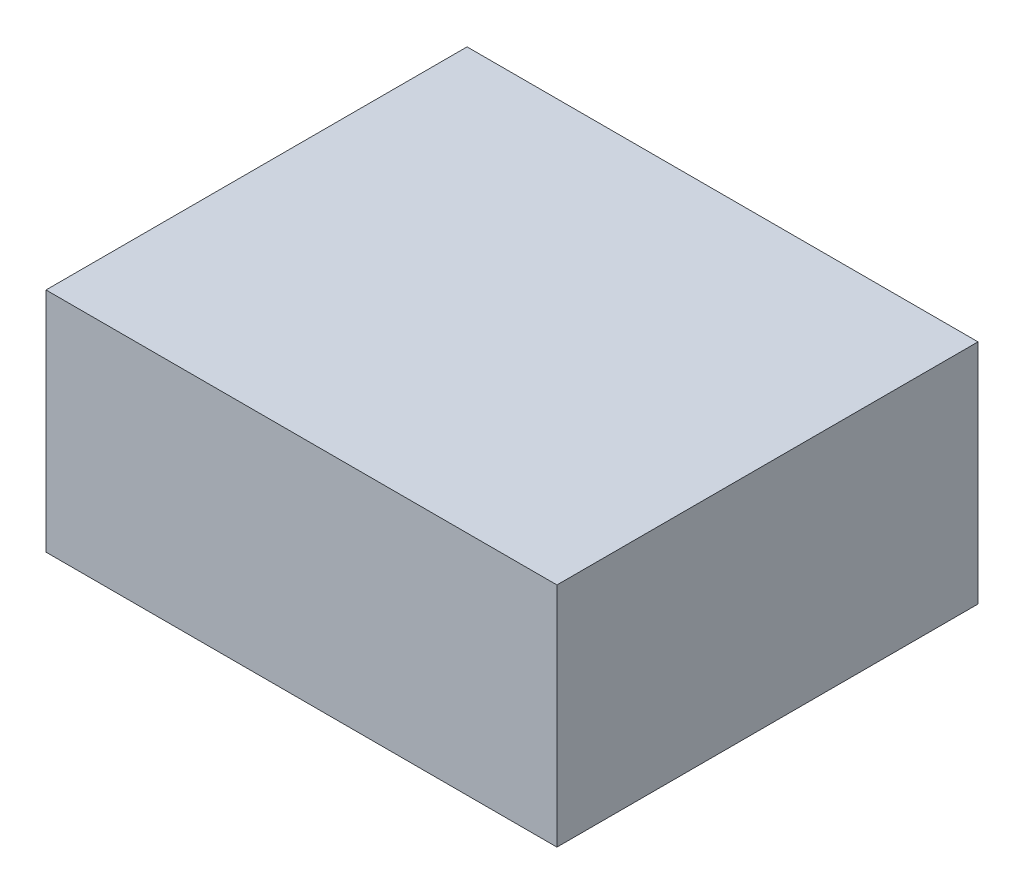
ISO-10303-21;
HEADER;
FILE_DESCRIPTION(('STEP AP214'),'2;1');
FILE_NAME('part.step','',(''),(''),'','','');
FILE_SCHEMA(('AUTOMOTIVE_DESIGN { 1 0 10303 214 1 1 1 1 }'));
ENDSEC;
DATA;
#1=APPLICATION_CONTEXT('core data for automotive mechanical design processes');
#2=APPLICATION_PROTOCOL_DEFINITION('international standard','automotive_design',2000,#1);
#3=PRODUCT_CONTEXT('',#1,'mechanical');
#4=PRODUCT('Part','Part','',(#3));
#5=PRODUCT_RELATED_PRODUCT_CATEGORY('part','',(#4));
#6=PRODUCT_DEFINITION_FORMATION('','',#4);
#7=PRODUCT_DEFINITION_CONTEXT('part definition',#1,'design');
#8=PRODUCT_DEFINITION('design','',#6,#7);
#9=PRODUCT_DEFINITION_SHAPE('','',#8);
#10=(LENGTH_UNIT() NAMED_UNIT(*) SI_UNIT(.MILLI.,.METRE.));
#11=(NAMED_UNIT(*) PLANE_ANGLE_UNIT() SI_UNIT($,.RADIAN.));
#12=(NAMED_UNIT(*) SI_UNIT($,.STERADIAN.) SOLID_ANGLE_UNIT());
#13=UNCERTAINTY_MEASURE_WITH_UNIT(LENGTH_MEASURE(1.E-05),#10,'distance_accuracy_value','');
#14=(GEOMETRIC_REPRESENTATION_CONTEXT(3) GLOBAL_UNCERTAINTY_ASSIGNED_CONTEXT((#13)) GLOBAL_UNIT_ASSIGNED_CONTEXT((#10,
#11,#12)) REPRESENTATION_CONTEXT('',''));
#15=CARTESIAN_POINT('',(0.,0.,0.));
#16=DIRECTION('',(0.,0.,1.));
#17=DIRECTION('',(1.,0.,0.));
#18=AXIS2_PLACEMENT_3D('',#15,#16,#17);
#19=CARTESIAN_POINT('',(5.4000019,-2.39999774,0.));
#20=DIRECTION('',(0.,-1.,0.));
#21=DIRECTION('',(0.,0.,-1.));
#22=AXIS2_PLACEMENT_3D('',#19,#20,#21);
#23=PLANE('',#22);
#24=DIRECTION('',(0.,0.,1.));
#25=VECTOR('',#24,1.);
#26=CARTESIAN_POINT('',(-5.4000019,-2.39999774,0.));
#27=LINE('',#26,#25);
#28=CARTESIAN_POINT('',(-5.4000019,-2.39999774,0.));
#29=VERTEX_POINT('',#28);
#30=CARTESIAN_POINT('',(-5.4000019,-2.39999774,8.89999998));
#31=VERTEX_POINT('',#30);
#32=EDGE_CURVE('E19',#29,#31,#27,.T.);
#33=ORIENTED_EDGE('',*,*,#32,.F.);
#34=DIRECTION('',(1.,0.,0.));
#35=VECTOR('',#34,1.);
#36=CARTESIAN_POINT('',(-5.4000019,-2.39999774,0.));
#37=LINE('',#36,#35);
#38=CARTESIAN_POINT('',(5.4000019,-2.39999774,0.));
#39=VERTEX_POINT('',#38);
#40=EDGE_CURVE('E92',#29,#39,#37,.T.);
#41=ORIENTED_EDGE('',*,*,#40,.T.);
#42=DIRECTION('',(0.,0.,-1.));
#43=VECTOR('',#42,1.);
#44=CARTESIAN_POINT('',(5.4000019,-2.39999774,0.));
#45=LINE('',#44,#43);
#46=CARTESIAN_POINT('',(5.4000019,-2.39999774,8.89999998));
#47=VERTEX_POINT('',#46);
#48=EDGE_CURVE('E66',#47,#39,#45,.T.);
#49=ORIENTED_EDGE('',*,*,#48,.F.);
#50=DIRECTION('',(1.,0.,0.));
#51=VECTOR('',#50,1.);
#52=CARTESIAN_POINT('',(-5.4000019,-2.39999774,8.89999998));
#53=LINE('',#52,#51);
#54=EDGE_CURVE('E60',#31,#47,#53,.T.);
#55=ORIENTED_EDGE('',*,*,#54,.F.);
#56=EDGE_LOOP('',(#33,#41,#49,#55));
#57=FACE_BOUND('',#56,.T.);
#58=ADVANCED_FACE('F16',(#57),#23,.T.);
#59=CARTESIAN_POINT('',(-5.4000019,-2.39999774,0.));
#60=DIRECTION('',(-1.,0.,0.));
#61=DIRECTION('',(0.,0.,1.));
#62=AXIS2_PLACEMENT_3D('',#59,#60,#61);
#63=PLANE('',#62);
#64=DIRECTION('',(0.,0.,1.));
#65=VECTOR('',#64,1.);
#66=CARTESIAN_POINT('',(-5.4000019,2.40000028,0.));
#67=LINE('',#66,#65);
#68=CARTESIAN_POINT('',(-5.4000019,2.40000028,0.));
#69=VERTEX_POINT('',#68);
#70=CARTESIAN_POINT('',(-5.4000019,2.40000028,8.89999998));
#71=VERTEX_POINT('',#70);
#72=EDGE_CURVE('E98',#69,#71,#67,.T.);
#73=ORIENTED_EDGE('',*,*,#72,.F.);
#74=DIRECTION('',(0.,1.,0.));
#75=VECTOR('',#74,1.);
#76=CARTESIAN_POINT('',(-5.4000019,-2.39999774,0.));
#77=LINE('',#76,#75);
#78=EDGE_CURVE('E74',#69,#29,#77,.F.);
#79=ORIENTED_EDGE('',*,*,#78,.T.);
#80=ORIENTED_EDGE('',*,*,#32,.T.);
#81=DIRECTION('',(0.,1.,0.));
#82=VECTOR('',#81,1.);
#83=CARTESIAN_POINT('',(-5.4000019,-2.39999774,8.89999998));
#84=LINE('',#83,#82);
#85=EDGE_CURVE('E69',#71,#31,#84,.F.);
#86=ORIENTED_EDGE('',*,*,#85,.F.);
#87=EDGE_LOOP('',(#73,#79,#80,#86));
#88=FACE_BOUND('',#87,.T.);
#89=ADVANCED_FACE('F71',(#88),#63,.T.);
#90=CARTESIAN_POINT('',(-5.4000019,-2.39999774,8.89999998));
#91=DIRECTION('',(0.,0.,1.));
#92=DIRECTION('',(1.,0.,0.));
#93=AXIS2_PLACEMENT_3D('',#90,#91,#92);
#94=PLANE('',#93);
#95=DIRECTION('',(1.,0.,0.));
#96=VECTOR('',#95,1.);
#97=CARTESIAN_POINT('',(-5.4000019,2.40000028,8.89999998));
#98=LINE('',#97,#96);
#99=CARTESIAN_POINT('',(5.4000019,2.40000028,8.89999998));
#100=VERTEX_POINT('',#99);
#101=EDGE_CURVE('E79',#71,#100,#98,.T.);
#102=ORIENTED_EDGE('',*,*,#101,.F.);
#103=ORIENTED_EDGE('',*,*,#85,.T.);
#104=ORIENTED_EDGE('',*,*,#54,.T.);
#105=DIRECTION('',(0.,1.,0.));
#106=VECTOR('',#105,1.);
#107=CARTESIAN_POINT('',(5.4000019,2.40000028,8.89999998));
#108=LINE('',#107,#106);
#109=EDGE_CURVE('E82',#100,#47,#108,.F.);
#110=ORIENTED_EDGE('',*,*,#109,.F.);
#111=EDGE_LOOP('',(#102,#103,#104,#110));
#112=FACE_BOUND('',#111,.T.);
#113=ADVANCED_FACE('F77',(#112),#94,.T.);
#114=CARTESIAN_POINT('',(5.4000019,2.40000028,0.));
#115=DIRECTION('',(1.,0.,0.));
#116=DIRECTION('',(0.,0.,-1.));
#117=AXIS2_PLACEMENT_3D('',#114,#115,#116);
#118=PLANE('',#117);
#119=ORIENTED_EDGE('',*,*,#48,.T.);
#120=DIRECTION('',(0.,1.,0.));
#121=VECTOR('',#120,1.);
#122=CARTESIAN_POINT('',(5.4000019,-2.39999774,0.));
#123=LINE('',#122,#121);
#124=CARTESIAN_POINT('',(5.4000019,2.40000028,0.));
#125=VERTEX_POINT('',#124);
#126=EDGE_CURVE('E38',#39,#125,#123,.T.);
#127=ORIENTED_EDGE('',*,*,#126,.T.);
#128=DIRECTION('',(0.,0.,1.));
#129=VECTOR('',#128,1.);
#130=CARTESIAN_POINT('',(5.4000019,2.40000028,0.));
#131=LINE('',#130,#129);
#132=EDGE_CURVE('E26',#100,#125,#131,.F.);
#133=ORIENTED_EDGE('',*,*,#132,.F.);
#134=ORIENTED_EDGE('',*,*,#109,.T.);
#135=EDGE_LOOP('',(#119,#127,#133,#134));
#136=FACE_BOUND('',#135,.T.);
#137=ADVANCED_FACE('F105',(#136),#118,.T.);
#138=CARTESIAN_POINT('',(-5.4000019,-2.39999774,0.));
#139=DIRECTION('',(0.,0.,1.));
#140=DIRECTION('',(1.,0.,0.));
#141=AXIS2_PLACEMENT_3D('',#138,#139,#140);
#142=PLANE('',#141);
#143=DIRECTION('',(1.,0.,0.));
#144=VECTOR('',#143,1.);
#145=CARTESIAN_POINT('',(-5.4000019,2.40000028,0.));
#146=LINE('',#145,#144);
#147=EDGE_CURVE('E11',#125,#69,#146,.F.);
#148=ORIENTED_EDGE('',*,*,#147,.F.);
#149=ORIENTED_EDGE('',*,*,#126,.F.);
#150=ORIENTED_EDGE('',*,*,#40,.F.);
#151=ORIENTED_EDGE('',*,*,#78,.F.);
#152=EDGE_LOOP('',(#148,#149,#150,#151));
#153=FACE_BOUND('',#152,.T.);
#154=ADVANCED_FACE('F107',(#153),#142,.F.);
#155=CARTESIAN_POINT('',(-5.4000019,2.40000028,0.));
#156=DIRECTION('',(0.,1.,0.));
#157=DIRECTION('',(0.,0.,1.));
#158=AXIS2_PLACEMENT_3D('',#155,#156,#157);
#159=PLANE('',#158);
#160=ORIENTED_EDGE('',*,*,#132,.T.);
#161=ORIENTED_EDGE('',*,*,#147,.T.);
#162=ORIENTED_EDGE('',*,*,#72,.T.);
#163=ORIENTED_EDGE('',*,*,#101,.T.);
#164=EDGE_LOOP('',(#160,#161,#162,#163));
#165=FACE_BOUND('',#164,.T.);
#166=ADVANCED_FACE('F104',(#165),#159,.T.);
#167=CLOSED_SHELL('',(#58,#89,#113,#137,#154,#166));
#168=MANIFOLD_SOLID_BREP('B1',#167);
#169=ADVANCED_BREP_SHAPE_REPRESENTATION('',(#18,#168),#14);
#170=SHAPE_DEFINITION_REPRESENTATION(#9,#169);
ENDSEC;
END-ISO-10303-21;
